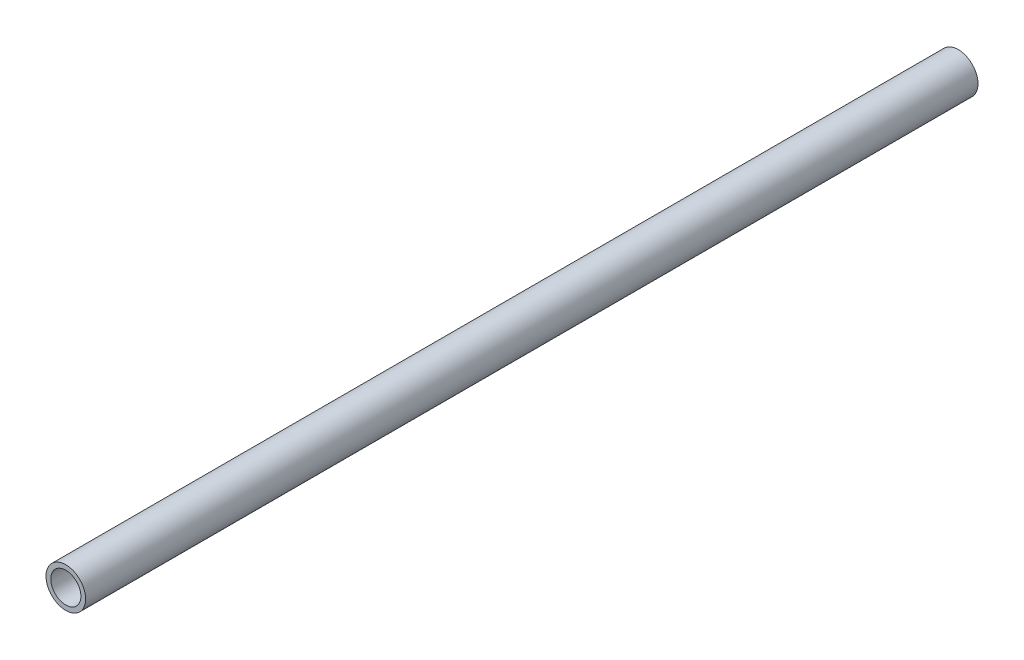
ISO-10303-21;
HEADER;
FILE_DESCRIPTION(('STEP AP214'),'2;1');
FILE_NAME('part.step','',(''),(''),'','','');
FILE_SCHEMA(('AUTOMOTIVE_DESIGN { 1 0 10303 214 1 1 1 1 }'));
ENDSEC;
DATA;
#1=APPLICATION_CONTEXT('core data for automotive mechanical design processes');
#2=APPLICATION_PROTOCOL_DEFINITION('international standard','automotive_design',2000,#1);
#3=PRODUCT_CONTEXT('',#1,'mechanical');
#4=PRODUCT('Part','Part','',(#3));
#5=PRODUCT_RELATED_PRODUCT_CATEGORY('part','',(#4));
#6=PRODUCT_DEFINITION_FORMATION('','',#4);
#7=PRODUCT_DEFINITION_CONTEXT('part definition',#1,'design');
#8=PRODUCT_DEFINITION('design','',#6,#7);
#9=PRODUCT_DEFINITION_SHAPE('','',#8);
#10=(LENGTH_UNIT() NAMED_UNIT(*) SI_UNIT(.MILLI.,.METRE.));
#11=(NAMED_UNIT(*) PLANE_ANGLE_UNIT() SI_UNIT($,.RADIAN.));
#12=(NAMED_UNIT(*) SI_UNIT($,.STERADIAN.) SOLID_ANGLE_UNIT());
#13=UNCERTAINTY_MEASURE_WITH_UNIT(LENGTH_MEASURE(1.E-05),#10,'distance_accuracy_value','');
#14=(GEOMETRIC_REPRESENTATION_CONTEXT(3) GLOBAL_UNCERTAINTY_ASSIGNED_CONTEXT((#13)) GLOBAL_UNIT_ASSIGNED_CONTEXT((#10,
#11,#12)) REPRESENTATION_CONTEXT('',''));
#15=CARTESIAN_POINT('',(0.,0.,0.));
#16=DIRECTION('',(0.,0.,1.));
#17=DIRECTION('',(1.,0.,0.));
#18=AXIS2_PLACEMENT_3D('',#15,#16,#17);
#19=CARTESIAN_POINT('',(0.,0.,398.334214382344));
#20=DIRECTION('',(0.,0.,-1.));
#21=DIRECTION('',(-1.,0.,0.));
#22=AXIS2_PLACEMENT_3D('',#19,#20,#21);
#23=CYLINDRICAL_SURFACE('',#22,8.35);
#24=CARTESIAN_POINT('',(0.,0.,374.716847890713));
#25=DIRECTION('',(0.,0.,1.));
#26=DIRECTION('',(0.,-1.,0.));
#27=AXIS2_PLACEMENT_3D('',#24,#25,#26);
#28=CIRCLE('',#27,8.35);
#29=CARTESIAN_POINT('',(0.,-8.35,374.716847890713));
#30=VERTEX_POINT('',#29);
#31=EDGE_CURVE('E10',#30,#30,#28,.T.);
#32=ORIENTED_EDGE('',*,*,#31,.F.);
#33=EDGE_LOOP('',(#32));
#34=FACE_BOUND('',#33,.T.);
#35=CARTESIAN_POINT('',(0.,0.,-1.21838214055976));
#36=DIRECTION('',(0.,0.,1.));
#37=DIRECTION('',(0.,-1.,0.));
#38=AXIS2_PLACEMENT_3D('',#35,#36,#37);
#39=CIRCLE('',#38,8.35);
#40=CARTESIAN_POINT('',(0.,-8.35,-1.21838214055974));
#41=VERTEX_POINT('',#40);
#42=EDGE_CURVE('E47',#41,#41,#39,.F.);
#43=ORIENTED_EDGE('',*,*,#42,.F.);
#44=EDGE_LOOP('',(#43));
#45=FACE_BOUND('',#44,.T.);
#46=ADVANCED_FACE('F33',(#34,#45),#23,.T.);
#47=CARTESIAN_POINT('',(0.,0.,398.334214382344));
#48=DIRECTION('',(0.,0.,-1.));
#49=DIRECTION('',(-1.,0.,0.));
#50=AXIS2_PLACEMENT_3D('',#47,#48,#49);
#51=CYLINDRICAL_SURFACE('',#50,6.35);
#52=CARTESIAN_POINT('',(0.,0.,374.716847890713));
#53=DIRECTION('',(0.,0.,1.));
#54=DIRECTION('',(0.,-1.,0.));
#55=AXIS2_PLACEMENT_3D('',#52,#53,#54);
#56=CIRCLE('',#55,6.35);
#57=CARTESIAN_POINT('',(0.,-6.35,374.716847890713));
#58=VERTEX_POINT('',#57);
#59=EDGE_CURVE('E36',#58,#58,#56,.T.);
#60=ORIENTED_EDGE('',*,*,#59,.T.);
#61=EDGE_LOOP('',(#60));
#62=FACE_BOUND('',#61,.T.);
#63=CARTESIAN_POINT('',(0.,0.,-1.21838214055976));
#64=DIRECTION('',(0.,0.,1.));
#65=DIRECTION('',(0.,-1.,0.));
#66=AXIS2_PLACEMENT_3D('',#63,#64,#65);
#67=CIRCLE('',#66,6.35);
#68=CARTESIAN_POINT('',(0.,-6.35,-1.21838214055975));
#69=VERTEX_POINT('',#68);
#70=EDGE_CURVE('E43',#69,#69,#67,.F.);
#71=ORIENTED_EDGE('',*,*,#70,.T.);
#72=EDGE_LOOP('',(#71));
#73=FACE_BOUND('',#72,.T.);
#74=ADVANCED_FACE('F55',(#62,#73),#51,.F.);
#75=CARTESIAN_POINT('',(1.74233495094055,6.10628929209323,374.716847890713));
#76=DIRECTION('',(0.,0.,1.));
#77=DIRECTION('',(0.961620360959548,-0.274383456841023,0.));
#78=AXIS2_PLACEMENT_3D('',#75,#76,#77);
#79=PLANE('',#78);
#80=ORIENTED_EDGE('',*,*,#59,.F.);
#81=EDGE_LOOP('',(#80));
#82=FACE_BOUND('',#81,.T.);
#83=ORIENTED_EDGE('',*,*,#31,.T.);
#84=EDGE_LOOP('',(#83));
#85=FACE_BOUND('',#84,.T.);
#86=ADVANCED_FACE('F60',(#82,#85),#79,.T.);
#87=CARTESIAN_POINT('',(-1.06481209954969E-11,9.50961380984855E-12,-1.21838214055976));
#88=DIRECTION('',(0.,0.,1.));
#89=DIRECTION('',(0.858413938254068,-0.512957610930125,0.));
#90=AXIS2_PLACEMENT_3D('',#87,#88,#89);
#91=PLANE('',#90);
#92=ORIENTED_EDGE('',*,*,#42,.T.);
#93=EDGE_LOOP('',(#92));
#94=FACE_BOUND('',#93,.T.);
#95=ORIENTED_EDGE('',*,*,#70,.F.);
#96=EDGE_LOOP('',(#95));
#97=FACE_BOUND('',#96,.T.);
#98=ADVANCED_FACE('F51',(#94,#97),#91,.F.);
#99=CLOSED_SHELL('',(#46,#74,#86,#98));
#100=MANIFOLD_SOLID_BREP('B2',#99);
#101=ADVANCED_BREP_SHAPE_REPRESENTATION('',(#18,#100),#14);
#102=SHAPE_DEFINITION_REPRESENTATION(#9,#101);
ENDSEC;
END-ISO-10303-21;
